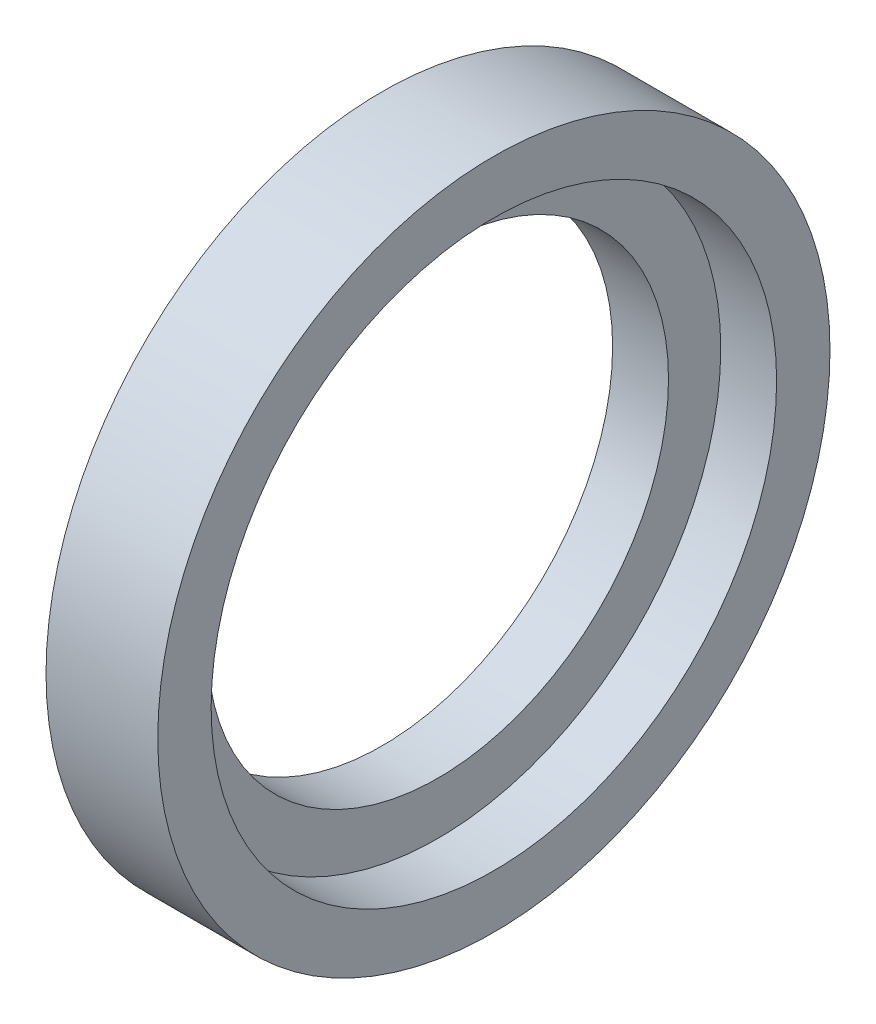
ISO-10303-21;
HEADER;
FILE_DESCRIPTION(('STEP AP214'),'2;1');
FILE_NAME('part.step','',(''),(''),'','','');
FILE_SCHEMA(('AUTOMOTIVE_DESIGN { 1 0 10303 214 1 1 1 1 }'));
ENDSEC;
DATA;
#1=APPLICATION_CONTEXT('core data for automotive mechanical design processes');
#2=APPLICATION_PROTOCOL_DEFINITION('international standard','automotive_design',2000,#1);
#3=PRODUCT_CONTEXT('',#1,'mechanical');
#4=PRODUCT('Part','Part','',(#3));
#5=PRODUCT_RELATED_PRODUCT_CATEGORY('part','',(#4));
#6=PRODUCT_DEFINITION_FORMATION('','',#4);
#7=PRODUCT_DEFINITION_CONTEXT('part definition',#1,'design');
#8=PRODUCT_DEFINITION('design','',#6,#7);
#9=PRODUCT_DEFINITION_SHAPE('','',#8);
#10=(LENGTH_UNIT() NAMED_UNIT(*) SI_UNIT(.MILLI.,.METRE.));
#11=(NAMED_UNIT(*) PLANE_ANGLE_UNIT() SI_UNIT($,.RADIAN.));
#12=(NAMED_UNIT(*) SI_UNIT($,.STERADIAN.) SOLID_ANGLE_UNIT());
#13=UNCERTAINTY_MEASURE_WITH_UNIT(LENGTH_MEASURE(1.E-05),#10,'distance_accuracy_value','');
#14=(GEOMETRIC_REPRESENTATION_CONTEXT(3) GLOBAL_UNCERTAINTY_ASSIGNED_CONTEXT((#13)) GLOBAL_UNIT_ASSIGNED_CONTEXT((#10,
#11,#12)) REPRESENTATION_CONTEXT('',''));
#15=CARTESIAN_POINT('',(0.,0.,0.));
#16=DIRECTION('',(0.,0.,1.));
#17=DIRECTION('',(1.,0.,0.));
#18=AXIS2_PLACEMENT_3D('',#15,#16,#17);
#19=CARTESIAN_POINT('',(10.,0.,0.));
#20=DIRECTION('',(-1.,0.,0.));
#21=DIRECTION('',(0.,0.,1.));
#22=AXIS2_PLACEMENT_3D('',#19,#20,#21);
#23=CYLINDRICAL_SURFACE('',#22,20.625);
#24=CARTESIAN_POINT('',(0.,0.,0.));
#25=DIRECTION('',(1.,0.,0.));
#26=DIRECTION('',(0.,0.,-1.));
#27=AXIS2_PLACEMENT_3D('',#24,#25,#26);
#28=CIRCLE('',#27,20.625);
#29=CARTESIAN_POINT('',(0.,0.,-20.625));
#30=VERTEX_POINT('',#29);
#31=EDGE_CURVE('E45',#30,#30,#28,.T.);
#32=ORIENTED_EDGE('',*,*,#31,.F.);
#33=EDGE_LOOP('',(#32));
#34=FACE_BOUND('',#33,.T.);
#35=CARTESIAN_POINT('',(5.,0.,0.));
#36=DIRECTION('',(1.,0.,0.));
#37=DIRECTION('',(0.,0.,-1.));
#38=AXIS2_PLACEMENT_3D('',#35,#36,#37);
#39=CIRCLE('',#38,20.625);
#40=CARTESIAN_POINT('',(5.,0.,-20.625));
#41=VERTEX_POINT('',#40);
#42=EDGE_CURVE('E36',#41,#41,#39,.T.);
#43=ORIENTED_EDGE('',*,*,#42,.T.);
#44=EDGE_LOOP('',(#43));
#45=FACE_BOUND('',#44,.T.);
#46=ADVANCED_FACE('F32',(#34,#45),#23,.F.);
#47=CARTESIAN_POINT('',(10.,0.,0.));
#48=DIRECTION('',(1.,0.,0.));
#49=DIRECTION('',(0.,0.,-1.));
#50=AXIS2_PLACEMENT_3D('',#47,#48,#49);
#51=PLANE('',#50);
#52=CARTESIAN_POINT('',(10.,0.,0.));
#53=DIRECTION('',(1.,0.,0.));
#54=DIRECTION('',(0.,0.,-1.));
#55=AXIS2_PLACEMENT_3D('',#52,#53,#54);
#56=CIRCLE('',#55,25.3);
#57=CARTESIAN_POINT('',(10.,0.,-25.3));
#58=VERTEX_POINT('',#57);
#59=EDGE_CURVE('E49',#58,#58,#56,.T.);
#60=ORIENTED_EDGE('',*,*,#59,.F.);
#61=EDGE_LOOP('',(#60));
#62=FACE_BOUND('',#61,.T.);
#63=CARTESIAN_POINT('',(10.,0.,0.));
#64=DIRECTION('',(1.,0.,0.));
#65=DIRECTION('',(0.,0.,-1.));
#66=AXIS2_PLACEMENT_3D('',#63,#64,#65);
#67=CIRCLE('',#66,30.075);
#68=CARTESIAN_POINT('',(10.,0.,-30.075));
#69=VERTEX_POINT('',#68);
#70=EDGE_CURVE('E10',#69,#69,#67,.T.);
#71=ORIENTED_EDGE('',*,*,#70,.T.);
#72=EDGE_LOOP('',(#71));
#73=FACE_BOUND('',#72,.T.);
#74=ADVANCED_FACE('F70',(#62,#73),#51,.T.);
#75=CARTESIAN_POINT('',(0.,0.,0.));
#76=DIRECTION('',(1.,0.,0.));
#77=DIRECTION('',(0.,0.,-1.));
#78=AXIS2_PLACEMENT_3D('',#75,#76,#77);
#79=PLANE('',#78);
#80=CARTESIAN_POINT('',(0.,0.,0.));
#81=DIRECTION('',(1.,0.,0.));
#82=DIRECTION('',(0.,0.,-1.));
#83=AXIS2_PLACEMENT_3D('',#80,#81,#82);
#84=CIRCLE('',#83,30.075);
#85=CARTESIAN_POINT('',(0.,0.,-30.075));
#86=VERTEX_POINT('',#85);
#87=EDGE_CURVE('E40',#86,#86,#84,.T.);
#88=ORIENTED_EDGE('',*,*,#87,.F.);
#89=EDGE_LOOP('',(#88));
#90=FACE_BOUND('',#89,.T.);
#91=ORIENTED_EDGE('',*,*,#31,.T.);
#92=EDGE_LOOP('',(#91));
#93=FACE_BOUND('',#92,.T.);
#94=ADVANCED_FACE('F76',(#90,#93),#79,.F.);
#95=CARTESIAN_POINT('',(10.,0.,0.));
#96=DIRECTION('',(-1.,0.,0.));
#97=DIRECTION('',(0.,0.,1.));
#98=AXIS2_PLACEMENT_3D('',#95,#96,#97);
#99=CYLINDRICAL_SURFACE('',#98,30.075);
#100=ORIENTED_EDGE('',*,*,#70,.F.);
#101=EDGE_LOOP('',(#100));
#102=FACE_BOUND('',#101,.T.);
#103=ORIENTED_EDGE('',*,*,#87,.T.);
#104=EDGE_LOOP('',(#103));
#105=FACE_BOUND('',#104,.T.);
#106=ADVANCED_FACE('F34',(#102,#105),#99,.T.);
#107=CARTESIAN_POINT('',(5.,0.,0.));
#108=DIRECTION('',(1.,0.,0.));
#109=DIRECTION('',(0.,0.,-1.));
#110=AXIS2_PLACEMENT_3D('',#107,#108,#109);
#111=CYLINDRICAL_SURFACE('',#110,25.3);
#112=CARTESIAN_POINT('',(5.,0.,0.));
#113=DIRECTION('',(1.,0.,0.));
#114=DIRECTION('',(0.,0.,-1.));
#115=AXIS2_PLACEMENT_3D('',#112,#113,#114);
#116=CIRCLE('',#115,25.3);
#117=CARTESIAN_POINT('',(5.,0.,-25.3));
#118=VERTEX_POINT('',#117);
#119=EDGE_CURVE('E52',#118,#118,#116,.T.);
#120=ORIENTED_EDGE('',*,*,#119,.F.);
#121=EDGE_LOOP('',(#120));
#122=FACE_BOUND('',#121,.T.);
#123=ORIENTED_EDGE('',*,*,#59,.T.);
#124=EDGE_LOOP('',(#123));
#125=FACE_BOUND('',#124,.T.);
#126=ADVANCED_FACE('F62',(#122,#125),#111,.F.);
#127=CARTESIAN_POINT('',(5.,0.,0.));
#128=DIRECTION('',(1.,0.,0.));
#129=DIRECTION('',(0.,0.,-1.));
#130=AXIS2_PLACEMENT_3D('',#127,#128,#129);
#131=PLANE('',#130);
#132=ORIENTED_EDGE('',*,*,#42,.F.);
#133=EDGE_LOOP('',(#132));
#134=FACE_BOUND('',#133,.T.);
#135=ORIENTED_EDGE('',*,*,#119,.T.);
#136=EDGE_LOOP('',(#135));
#137=FACE_BOUND('',#136,.T.);
#138=ADVANCED_FACE('F60',(#134,#137),#131,.T.);
#139=CLOSED_SHELL('',(#46,#74,#94,#106,#126,#138));
#140=MANIFOLD_SOLID_BREP('B2',#139);
#141=ADVANCED_BREP_SHAPE_REPRESENTATION('',(#18,#140),#14);
#142=SHAPE_DEFINITION_REPRESENTATION(#9,#141);
ENDSEC;
END-ISO-10303-21;
